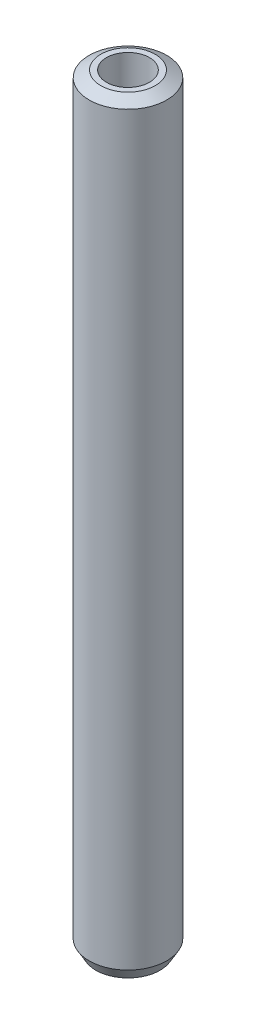
ISO-10303-21;
HEADER;
FILE_DESCRIPTION(('STEP AP214'),'2;1');
FILE_NAME('part.step','',(''),(''),'','','');
FILE_SCHEMA(('AUTOMOTIVE_DESIGN { 1 0 10303 214 1 1 1 1 }'));
ENDSEC;
DATA;
#1=APPLICATION_CONTEXT('core data for automotive mechanical design processes');
#2=APPLICATION_PROTOCOL_DEFINITION('international standard','automotive_design',2000,#1);
#3=PRODUCT_CONTEXT('',#1,'mechanical');
#4=PRODUCT('Part','Part','',(#3));
#5=PRODUCT_RELATED_PRODUCT_CATEGORY('part','',(#4));
#6=PRODUCT_DEFINITION_FORMATION('','',#4);
#7=PRODUCT_DEFINITION_CONTEXT('part definition',#1,'design');
#8=PRODUCT_DEFINITION('design','',#6,#7);
#9=PRODUCT_DEFINITION_SHAPE('','',#8);
#10=(LENGTH_UNIT() NAMED_UNIT(*) SI_UNIT(.MILLI.,.METRE.));
#11=(NAMED_UNIT(*) PLANE_ANGLE_UNIT() SI_UNIT($,.RADIAN.));
#12=(NAMED_UNIT(*) SI_UNIT($,.STERADIAN.) SOLID_ANGLE_UNIT());
#13=UNCERTAINTY_MEASURE_WITH_UNIT(LENGTH_MEASURE(1.E-05),#10,'distance_accuracy_value','');
#14=(GEOMETRIC_REPRESENTATION_CONTEXT(3) GLOBAL_UNCERTAINTY_ASSIGNED_CONTEXT((#13)) GLOBAL_UNIT_ASSIGNED_CONTEXT((#10,
#11,#12)) REPRESENTATION_CONTEXT('',''));
#15=CARTESIAN_POINT('',(0.,0.,0.));
#16=DIRECTION('',(0.,0.,1.));
#17=DIRECTION('',(1.,0.,0.));
#18=AXIS2_PLACEMENT_3D('',#15,#16,#17);
#19=CARTESIAN_POINT('',(0.,246.28317897152,0.));
#20=DIRECTION('',(0.,-1.,0.));
#21=DIRECTION('',(0.,0.,-1.));
#22=AXIS2_PLACEMENT_3D('',#19,#20,#21);
#23=CYLINDRICAL_SURFACE('',#22,12.5);
#24=CARTESIAN_POINT('',(0.,244.133495946875,0.));
#25=DIRECTION('',(0.,1.,0.));
#26=DIRECTION('',(0.,0.,1.));
#27=AXIS2_PLACEMENT_3D('',#24,#25,#26);
#28=CIRCLE('',#27,12.5);
#29=CARTESIAN_POINT('',(0.,244.133495946875,12.5));
#30=VERTEX_POINT('',#29);
#31=EDGE_CURVE('E50',#30,#30,#28,.F.);
#32=ORIENTED_EDGE('',*,*,#31,.T.);
#33=EDGE_LOOP('',(#32));
#34=FACE_BOUND('',#33,.T.);
#35=CARTESIAN_POINT('',(0.,3.723360218853,0.));
#36=DIRECTION('',(0.,1.,0.));
#37=DIRECTION('',(0.,0.,1.));
#38=AXIS2_PLACEMENT_3D('',#35,#36,#37);
#39=CIRCLE('',#38,12.5);
#40=CARTESIAN_POINT('',(0.,3.723360218853,12.5));
#41=VERTEX_POINT('',#40);
#42=EDGE_CURVE('E51',#41,#41,#39,.T.);
#43=ORIENTED_EDGE('',*,*,#42,.T.);
#44=EDGE_LOOP('',(#43));
#45=FACE_BOUND('',#44,.T.);
#46=ADVANCED_FACE('F39',(#34,#45),#23,.T.);
#47=CARTESIAN_POINT('',(0.,246.28317897152,0.));
#48=DIRECTION('',(0.,1.,0.));
#49=DIRECTION('',(0.,0.,1.));
#50=AXIS2_PLACEMENT_3D('',#47,#48,#49);
#51=PLANE('',#50);
#52=CARTESIAN_POINT('',(0.,246.28317897152,0.));
#53=DIRECTION('',(0.,1.,0.));
#54=DIRECTION('',(0.,0.,1.));
#55=AXIS2_PLACEMENT_3D('',#52,#53,#54);
#56=CIRCLE('',#55,8.77663978114704);
#57=CARTESIAN_POINT('',(0.,246.28317897152,8.77663978114704));
#58=VERTEX_POINT('',#57);
#59=EDGE_CURVE('E54',#58,#58,#56,.T.);
#60=ORIENTED_EDGE('',*,*,#59,.T.);
#61=EDGE_LOOP('',(#60));
#62=FACE_BOUND('',#61,.T.);
#63=CARTESIAN_POINT('',(0.,246.28317897152,0.));
#64=DIRECTION('',(0.,1.,0.));
#65=DIRECTION('',(0.,0.,1.));
#66=AXIS2_PLACEMENT_3D('',#63,#64,#65);
#67=CIRCLE('',#66,6.9291630144673);
#68=CARTESIAN_POINT('',(0.,246.28317897152,6.9291630144673));
#69=VERTEX_POINT('',#68);
#70=EDGE_CURVE('E58',#69,#69,#67,.T.);
#71=ORIENTED_EDGE('',*,*,#70,.F.);
#72=EDGE_LOOP('',(#71));
#73=FACE_BOUND('',#72,.T.);
#74=ADVANCED_FACE('F69',(#62,#73),#51,.T.);
#75=CARTESIAN_POINT('',(0.,0.,0.));
#76=DIRECTION('',(0.,1.,0.));
#77=DIRECTION('',(0.,0.,1.));
#78=AXIS2_PLACEMENT_3D('',#75,#76,#77);
#79=PLANE('',#78);
#80=CARTESIAN_POINT('',(0.,0.,0.));
#81=DIRECTION('',(0.,1.,0.));
#82=DIRECTION('',(0.,0.,1.));
#83=AXIS2_PLACEMENT_3D('',#80,#81,#82);
#84=CIRCLE('',#83,10.3503169753553);
#85=CARTESIAN_POINT('',(0.,0.,10.3503169753553));
#86=VERTEX_POINT('',#85);
#87=EDGE_CURVE('E10',#86,#86,#84,.F.);
#88=ORIENTED_EDGE('',*,*,#87,.T.);
#89=EDGE_LOOP('',(#88));
#90=FACE_BOUND('',#89,.T.);
#91=CARTESIAN_POINT('',(0.,0.,0.));
#92=DIRECTION('',(0.,1.,0.));
#93=DIRECTION('',(0.,0.,1.));
#94=AXIS2_PLACEMENT_3D('',#91,#92,#93);
#95=CIRCLE('',#94,6.9291630144673);
#96=CARTESIAN_POINT('',(0.,0.,6.9291630144673));
#97=VERTEX_POINT('',#96);
#98=EDGE_CURVE('E63',#97,#97,#95,.T.);
#99=ORIENTED_EDGE('',*,*,#98,.T.);
#100=EDGE_LOOP('',(#99));
#101=FACE_BOUND('',#100,.T.);
#102=ADVANCED_FACE('F75',(#90,#101),#79,.F.);
#103=CARTESIAN_POINT('',(0.,246.28317897152,0.));
#104=DIRECTION('',(0.,-1.,0.));
#105=DIRECTION('',(0.,0.,-1.));
#106=AXIS2_PLACEMENT_3D('',#103,#104,#105);
#107=CYLINDRICAL_SURFACE('',#106,6.9291630144673);
#108=ORIENTED_EDGE('',*,*,#70,.T.);
#109=EDGE_LOOP('',(#108));
#110=FACE_BOUND('',#109,.T.);
#111=ORIENTED_EDGE('',*,*,#98,.F.);
#112=EDGE_LOOP('',(#111));
#113=FACE_BOUND('',#112,.T.);
#114=ADVANCED_FACE('F70',(#110,#113),#107,.F.);
#115=CARTESIAN_POINT('',(0.,246.28317897152,0.));
#116=DIRECTION('',(0.,-1.,0.));
#117=DIRECTION('',(0.,0.,-1.));
#118=AXIS2_PLACEMENT_3D('',#115,#116,#117);
#119=CONICAL_SURFACE('',#118,8.77663978114704,1.04719755119659);
#120=ORIENTED_EDGE('',*,*,#31,.F.);
#121=EDGE_LOOP('',(#120));
#122=FACE_BOUND('',#121,.T.);
#123=ORIENTED_EDGE('',*,*,#59,.F.);
#124=EDGE_LOOP('',(#123));
#125=FACE_BOUND('',#124,.T.);
#126=ADVANCED_FACE('F81',(#122,#125),#119,.T.);
#127=CARTESIAN_POINT('',(0.,3.723360218853,0.));
#128=DIRECTION('',(0.,1.,0.));
#129=DIRECTION('',(0.,0.,1.));
#130=AXIS2_PLACEMENT_3D('',#127,#128,#129);
#131=CONICAL_SURFACE('',#130,12.5,0.523598775598301);
#132=ORIENTED_EDGE('',*,*,#87,.F.);
#133=EDGE_LOOP('',(#132));
#134=FACE_BOUND('',#133,.T.);
#135=ORIENTED_EDGE('',*,*,#42,.F.);
#136=EDGE_LOOP('',(#135));
#137=FACE_BOUND('',#136,.T.);
#138=ADVANCED_FACE('F45',(#134,#137),#131,.T.);
#139=CLOSED_SHELL('',(#46,#74,#102,#114,#126,#138));
#140=MANIFOLD_SOLID_BREP('B2',#139);
#141=ADVANCED_BREP_SHAPE_REPRESENTATION('',(#18,#140),#14);
#142=SHAPE_DEFINITION_REPRESENTATION(#9,#141);
ENDSEC;
END-ISO-10303-21;
